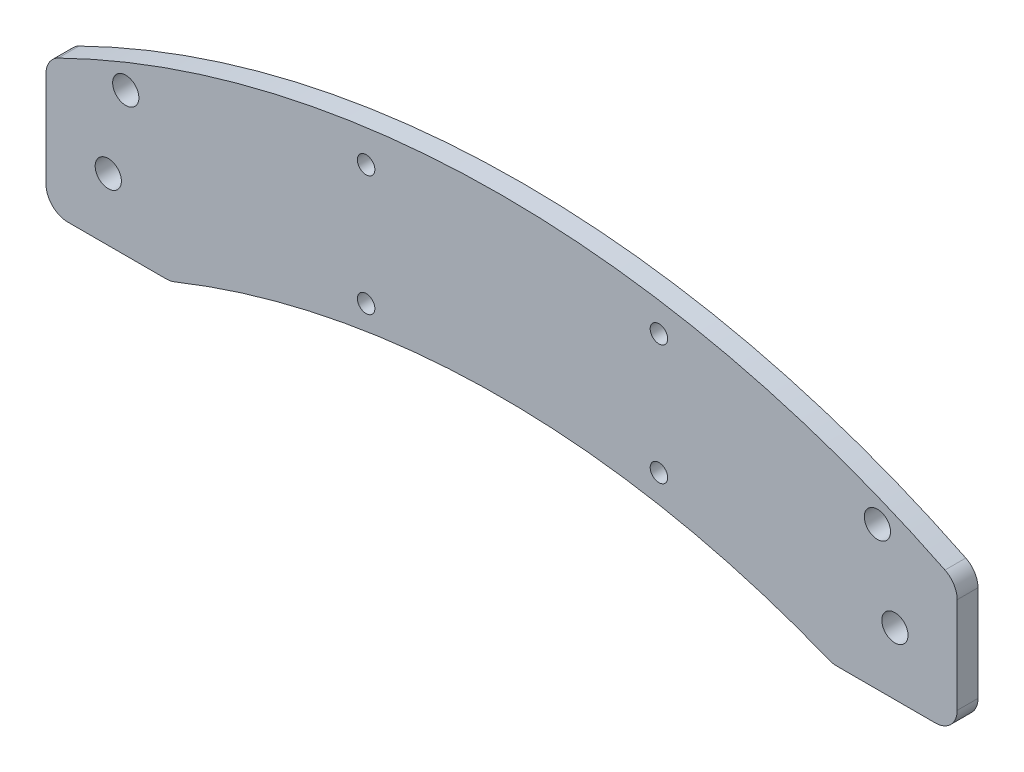
ISO-10303-21;
HEADER;
FILE_DESCRIPTION(('STEP AP214'),'2;1');
FILE_NAME('part.step','',(''),(''),'','','');
FILE_SCHEMA(('AUTOMOTIVE_DESIGN { 1 0 10303 214 1 1 1 1 }'));
ENDSEC;
DATA;
#1=APPLICATION_CONTEXT('core data for automotive mechanical design processes');
#2=APPLICATION_PROTOCOL_DEFINITION('international standard','automotive_design',2000,#1);
#3=PRODUCT_CONTEXT('',#1,'mechanical');
#4=PRODUCT('Part','Part','',(#3));
#5=PRODUCT_RELATED_PRODUCT_CATEGORY('part','',(#4));
#6=PRODUCT_DEFINITION_FORMATION('','',#4);
#7=PRODUCT_DEFINITION_CONTEXT('part definition',#1,'design');
#8=PRODUCT_DEFINITION('design','',#6,#7);
#9=PRODUCT_DEFINITION_SHAPE('','',#8);
#10=(LENGTH_UNIT() NAMED_UNIT(*) SI_UNIT(.MILLI.,.METRE.));
#11=(NAMED_UNIT(*) PLANE_ANGLE_UNIT() SI_UNIT($,.RADIAN.));
#12=(NAMED_UNIT(*) SI_UNIT($,.STERADIAN.) SOLID_ANGLE_UNIT());
#13=UNCERTAINTY_MEASURE_WITH_UNIT(LENGTH_MEASURE(1.E-05),#10,'distance_accuracy_value','');
#14=(GEOMETRIC_REPRESENTATION_CONTEXT(3) GLOBAL_UNCERTAINTY_ASSIGNED_CONTEXT((#13)) GLOBAL_UNIT_ASSIGNED_CONTEXT((#10,
#11,#12)) REPRESENTATION_CONTEXT('',''));
#15=CARTESIAN_POINT('',(0.,0.,0.));
#16=DIRECTION('',(0.,0.,1.));
#17=DIRECTION('',(1.,0.,0.));
#18=AXIS2_PLACEMENT_3D('',#15,#16,#17);
#19=CARTESIAN_POINT('',(-9.24999999999994,12.676812236513,0.));
#20=DIRECTION('',(0.,0.,-1.));
#21=DIRECTION('',(-1.,0.,0.));
#22=AXIS2_PLACEMENT_3D('',#19,#20,#21);
#23=PLANE('',#22);
#24=DIRECTION('',(-1.,0.,0.));
#25=VECTOR('',#24,1.);
#26=CARTESIAN_POINT('',(-10.,10.,0.));
#27=LINE('',#26,#25);
#28=CARTESIAN_POINT('',(10.,10.,0.));
#29=VERTEX_POINT('',#28);
#30=CARTESIAN_POINT('',(-10.,10.,0.));
#31=VERTEX_POINT('',#30);
#32=EDGE_CURVE('E209',#29,#31,#27,.T.);
#33=ORIENTED_EDGE('',*,*,#32,.T.);
#34=DIRECTION('',(0.,-1.,0.));
#35=VECTOR('',#34,1.);
#36=CARTESIAN_POINT('',(-10.,10.,0.));
#37=LINE('',#36,#35);
#38=CARTESIAN_POINT('',(-10.,-10.,0.));
#39=VERTEX_POINT('',#38);
#40=EDGE_CURVE('E62',#31,#39,#37,.T.);
#41=ORIENTED_EDGE('',*,*,#40,.T.);
#42=DIRECTION('',(1.,0.,0.));
#43=VECTOR('',#42,1.);
#44=CARTESIAN_POINT('',(-10.,-10.,0.));
#45=LINE('',#44,#43);
#46=CARTESIAN_POINT('',(10.,-10.,0.));
#47=VERTEX_POINT('',#46);
#48=EDGE_CURVE('E217',#39,#47,#45,.T.);
#49=ORIENTED_EDGE('',*,*,#48,.T.);
#50=DIRECTION('',(0.,1.,0.));
#51=VECTOR('',#50,1.);
#52=CARTESIAN_POINT('',(10.,10.,0.));
#53=LINE('',#52,#51);
#54=EDGE_CURVE('E220',#47,#29,#53,.T.);
#55=ORIENTED_EDGE('',*,*,#54,.T.);
#56=EDGE_LOOP('',(#33,#41,#49,#55));
#57=FACE_BOUND('',#56,.T.);
#58=CARTESIAN_POINT('',(4.00000000000005,18.5,0.));
#59=DIRECTION('',(0.,0.,1.));
#60=DIRECTION('',(1.,0.,0.));
#61=AXIS2_PLACEMENT_3D('',#58,#59,#60);
#62=CIRCLE('',#61,3.00000000000224);
#63=CARTESIAN_POINT('',(7.00000000000229,18.5,0.));
#64=VERTEX_POINT('',#63);
#65=EDGE_CURVE('E236',#64,#64,#62,.T.);
#66=ORIENTED_EDGE('',*,*,#65,.T.);
#67=EDGE_LOOP('',(#66));
#68=FACE_BOUND('',#67,.T.);
#69=CARTESIAN_POINT('',(125.999999999998,31.2500000000083,0.));
#70=DIRECTION('',(0.,0.,1.));
#71=DIRECTION('',(1.,0.,0.));
#72=AXIS2_PLACEMENT_3D('',#69,#70,#71);
#73=CIRCLE('',#72,2.);
#74=CARTESIAN_POINT('',(127.999999999998,31.2500000000083,0.));
#75=VERTEX_POINT('',#74);
#76=EDGE_CURVE('E255',#75,#75,#73,.T.);
#77=ORIENTED_EDGE('',*,*,#76,.T.);
#78=EDGE_LOOP('',(#77));
#79=FACE_BOUND('',#78,.T.);
#80=CARTESIAN_POINT('',(58.9999999999979,31.2500000000038,0.));
#81=DIRECTION('',(0.,0.,1.));
#82=DIRECTION('',(1.,0.,0.));
#83=AXIS2_PLACEMENT_3D('',#80,#81,#82);
#84=CIRCLE('',#83,1.99999999999999);
#85=CARTESIAN_POINT('',(60.9999999999979,31.2500000000038,0.));
#86=VERTEX_POINT('',#85);
#87=EDGE_CURVE('E267',#86,#86,#84,.T.);
#88=ORIENTED_EDGE('',*,*,#87,.T.);
#89=EDGE_LOOP('',(#88));
#90=FACE_BOUND('',#89,.T.);
#91=CARTESIAN_POINT('',(-9.24999999999994,12.676812236513,0.));
#92=DIRECTION('',(0.,0.,1.));
#93=DIRECTION('',(-1.,0.,0.));
#94=AXIS2_PLACEMENT_3D('',#91,#92,#93);
#95=CIRCLE('',#94,5.00000000000002);
#96=CARTESIAN_POINT('',(-11.4555555555555,17.1640747306577,0.));
#97=VERTEX_POINT('',#96);
#98=CARTESIAN_POINT('',(-14.2499999999999,12.676812236513,0.));
#99=VERTEX_POINT('',#98);
#100=EDGE_CURVE('E273',#97,#99,#95,.T.);
#101=ORIENTED_EDGE('',*,*,#100,.F.);
#102=CARTESIAN_POINT('',(90.0000000000002,-189.25,0.));
#103=DIRECTION('',(0.,0.,1.));
#104=DIRECTION('',(-1.,0.,0.));
#105=AXIS2_PLACEMENT_3D('',#102,#103,#104);
#106=CIRCLE('',#105,230.);
#107=CARTESIAN_POINT('',(191.455555555556,17.1640747306579,0.));
#108=VERTEX_POINT('',#107);
#109=EDGE_CURVE('E280',#108,#97,#106,.T.);
#110=ORIENTED_EDGE('',*,*,#109,.F.);
#111=CARTESIAN_POINT('',(189.25,12.6768122365132,0.));
#112=DIRECTION('',(0.,0.,1.));
#113=DIRECTION('',(-1.,0.,0.));
#114=AXIS2_PLACEMENT_3D('',#111,#112,#113);
#115=CIRCLE('',#114,5.00000000000002);
#116=CARTESIAN_POINT('',(194.25,12.6768122365132,0.));
#117=VERTEX_POINT('',#116);
#118=EDGE_CURVE('E323',#117,#108,#115,.T.);
#119=ORIENTED_EDGE('',*,*,#118,.F.);
#120=DIRECTION('',(0.,1.,0.));
#121=VECTOR('',#120,1.);
#122=CARTESIAN_POINT('',(194.25,12.6768122365132,0.));
#123=LINE('',#122,#121);
#124=CARTESIAN_POINT('',(194.25,-9.24999999999996,0.));
#125=VERTEX_POINT('',#124);
#126=EDGE_CURVE('E321',#125,#117,#123,.T.);
#127=ORIENTED_EDGE('',*,*,#126,.F.);
#128=CARTESIAN_POINT('',(189.25,-9.24999999999999,0.));
#129=DIRECTION('',(0.,0.,1.));
#130=DIRECTION('',(-1.,0.,0.));
#131=AXIS2_PLACEMENT_3D('',#128,#129,#130);
#132=CIRCLE('',#131,5.);
#133=CARTESIAN_POINT('',(189.25,-14.25,0.));
#134=VERTEX_POINT('',#133);
#135=EDGE_CURVE('E319',#134,#125,#132,.T.);
#136=ORIENTED_EDGE('',*,*,#135,.F.);
#137=DIRECTION('',(1.,0.,0.));
#138=VECTOR('',#137,1.);
#139=CARTESIAN_POINT('',(189.25,-14.25,0.));
#140=LINE('',#139,#138);
#141=CARTESIAN_POINT('',(166.727208071205,-14.2499999999998,0.));
#142=VERTEX_POINT('',#141);
#143=EDGE_CURVE('E317',#142,#134,#140,.T.);
#144=ORIENTED_EDGE('',*,*,#143,.F.);
#145=CARTESIAN_POINT('',(166.727208071205,-9.24999999999981,0.));
#146=DIRECTION('',(0.,0.,1.));
#147=DIRECTION('',(-1.,0.,0.));
#148=AXIS2_PLACEMENT_3D('',#145,#146,#147);
#149=CIRCLE('',#148,5.);
#150=CARTESIAN_POINT('',(164.855812752395,-13.8865805892635,0.));
#151=VERTEX_POINT('',#150);
#152=EDGE_CURVE('E315',#151,#142,#149,.T.);
#153=ORIENTED_EDGE('',*,*,#152,.F.);
#154=CARTESIAN_POINT('',(90.0000000000002,-199.34980415981,0.));
#155=DIRECTION('',(0.,0.,-1.));
#156=DIRECTION('',(1.,0.,0.));
#157=AXIS2_PLACEMENT_3D('',#154,#155,#156);
#158=CIRCLE('',#157,200.);
#159=CARTESIAN_POINT('',(15.1441872476054,-13.8865805892636,0.));
#160=VERTEX_POINT('',#159);
#161=EDGE_CURVE('E313',#160,#151,#158,.T.);
#162=ORIENTED_EDGE('',*,*,#161,.F.);
#163=CARTESIAN_POINT('',(13.2727919287955,-9.24999999999995,0.));
#164=DIRECTION('',(0.,0.,1.));
#165=DIRECTION('',(-1.,0.,0.));
#166=AXIS2_PLACEMENT_3D('',#163,#164,#165);
#167=CIRCLE('',#166,5.00000000000002);
#168=CARTESIAN_POINT('',(13.2727919287955,-14.25,0.));
#169=VERTEX_POINT('',#168);
#170=EDGE_CURVE('E311',#169,#160,#167,.T.);
#171=ORIENTED_EDGE('',*,*,#170,.F.);
#172=DIRECTION('',(1.,0.,0.));
#173=VECTOR('',#172,1.);
#174=CARTESIAN_POINT('',(13.2727919287955,-14.25,0.));
#175=LINE('',#174,#173);
#176=CARTESIAN_POINT('',(-9.24999999999712,-14.2500000000014,0.));
#177=VERTEX_POINT('',#176);
#178=EDGE_CURVE('E309',#177,#169,#175,.T.);
#179=ORIENTED_EDGE('',*,*,#178,.F.);
#180=CARTESIAN_POINT('',(-9.24999999999715,-9.25000000000141,0.));
#181=DIRECTION('',(0.,0.,1.));
#182=DIRECTION('',(1.,0.,0.));
#183=AXIS2_PLACEMENT_3D('',#180,#181,#182);
#184=CIRCLE('',#183,5.);
#185=CARTESIAN_POINT('',(-14.2499999999972,-9.25000000000138,0.));
#186=VERTEX_POINT('',#185);
#187=EDGE_CURVE('E307',#186,#177,#184,.T.);
#188=ORIENTED_EDGE('',*,*,#187,.F.);
#189=DIRECTION('',(1.26978383766439E-13,-1.,0.));
#190=VECTOR('',#189,1.);
#191=CARTESIAN_POINT('',(-14.2499999999972,-9.25000000000138,0.));
#192=LINE('',#191,#190);
#193=EDGE_CURVE('E305',#99,#186,#192,.T.);
#194=ORIENTED_EDGE('',*,*,#193,.F.);
#195=EDGE_LOOP('',(#101,#110,#119,#127,#136,#144,#153,#162,#171,#179,#188,#194));
#196=FACE_BOUND('',#195,.T.);
#197=CARTESIAN_POINT('',(58.9999999999998,3.75000000000379,0.));
#198=DIRECTION('',(0.,0.,1.));
#199=DIRECTION('',(1.,0.,0.));
#200=AXIS2_PLACEMENT_3D('',#197,#198,#199);
#201=CIRCLE('',#200,1.99999999999999);
#202=CARTESIAN_POINT('',(60.9999999999998,3.75000000000379,0.));
#203=VERTEX_POINT('',#202);
#204=EDGE_CURVE('E261',#203,#203,#201,.T.);
#205=ORIENTED_EDGE('',*,*,#204,.T.);
#206=EDGE_LOOP('',(#205));
#207=FACE_BOUND('',#206,.T.);
#208=CARTESIAN_POINT('',(126.,3.75000000000828,0.));
#209=DIRECTION('',(0.,0.,1.));
#210=DIRECTION('',(1.,0.,0.));
#211=AXIS2_PLACEMENT_3D('',#208,#209,#210);
#212=CIRCLE('',#211,2.);
#213=CARTESIAN_POINT('',(128.,3.75000000000828,0.));
#214=VERTEX_POINT('',#213);
#215=EDGE_CURVE('E251',#214,#214,#212,.T.);
#216=ORIENTED_EDGE('',*,*,#215,.T.);
#217=EDGE_LOOP('',(#216));
#218=FACE_BOUND('',#217,.T.);
#219=CARTESIAN_POINT('',(176.,18.5000000000002,0.));
#220=DIRECTION('',(0.,0.,1.));
#221=DIRECTION('',(1.,0.,0.));
#222=AXIS2_PLACEMENT_3D('',#219,#220,#221);
#223=CIRCLE('',#222,2.99999999999999);
#224=CARTESIAN_POINT('',(179.,18.5000000000002,0.));
#225=VERTEX_POINT('',#224);
#226=EDGE_CURVE('E237',#225,#225,#223,.T.);
#227=ORIENTED_EDGE('',*,*,#226,.T.);
#228=EDGE_LOOP('',(#227));
#229=FACE_BOUND('',#228,.T.);
#230=DIRECTION('',(-1.,0.,0.));
#231=VECTOR('',#230,1.);
#232=CARTESIAN_POINT('',(170.,10.,0.));
#233=LINE('',#232,#231);
#234=CARTESIAN_POINT('',(190.,10.,0.));
#235=VERTEX_POINT('',#234);
#236=CARTESIAN_POINT('',(170.,10.,0.));
#237=VERTEX_POINT('',#236);
#238=EDGE_CURVE('E193',#235,#237,#233,.T.);
#239=ORIENTED_EDGE('',*,*,#238,.T.);
#240=DIRECTION('',(0.,-1.,0.));
#241=VECTOR('',#240,1.);
#242=CARTESIAN_POINT('',(170.,10.,0.));
#243=LINE('',#242,#241);
#244=CARTESIAN_POINT('',(170.,-9.99999999999996,0.));
#245=VERTEX_POINT('',#244);
#246=EDGE_CURVE('E54',#237,#245,#243,.T.);
#247=ORIENTED_EDGE('',*,*,#246,.T.);
#248=DIRECTION('',(1.,0.,0.));
#249=VECTOR('',#248,1.);
#250=CARTESIAN_POINT('',(170.,-9.99999999999996,0.));
#251=LINE('',#250,#249);
#252=CARTESIAN_POINT('',(190.,-9.99999999999996,0.));
#253=VERTEX_POINT('',#252);
#254=EDGE_CURVE('E197',#245,#253,#251,.T.);
#255=ORIENTED_EDGE('',*,*,#254,.T.);
#256=DIRECTION('',(0.,1.,0.));
#257=VECTOR('',#256,1.);
#258=CARTESIAN_POINT('',(190.,10.,0.));
#259=LINE('',#258,#257);
#260=EDGE_CURVE('E392',#253,#235,#259,.T.);
#261=ORIENTED_EDGE('',*,*,#260,.T.);
#262=EDGE_LOOP('',(#239,#247,#255,#261));
#263=FACE_BOUND('',#262,.T.);
#264=ADVANCED_FACE('F37',(#57,#68,#79,#90,#196,#207,#218,#229,#263),#23,.T.);
#265=CARTESIAN_POINT('',(-9.24999999999994,12.676812236513,4.7625));
#266=DIRECTION('',(0.,0.,-1.));
#267=DIRECTION('',(-1.,0.,0.));
#268=AXIS2_PLACEMENT_3D('',#265,#266,#267);
#269=PLANE('',#268);
#270=CARTESIAN_POINT('',(4.00000000000005,18.5,4.7625));
#271=DIRECTION('',(0.,0.,1.));
#272=DIRECTION('',(1.,0.,0.));
#273=AXIS2_PLACEMENT_3D('',#270,#271,#272);
#274=CIRCLE('',#273,3.00000000000224);
#275=CARTESIAN_POINT('',(7.00000000000229,18.5,4.7625));
#276=VERTEX_POINT('',#275);
#277=EDGE_CURVE('E240',#276,#276,#274,.T.);
#278=ORIENTED_EDGE('',*,*,#277,.F.);
#279=EDGE_LOOP('',(#278));
#280=FACE_BOUND('',#279,.T.);
#281=CARTESIAN_POINT('',(180.,0.,4.7625));
#282=DIRECTION('',(0.,0.,1.));
#283=DIRECTION('',(1.,0.,0.));
#284=AXIS2_PLACEMENT_3D('',#281,#282,#283);
#285=CIRCLE('',#284,2.99999999999999);
#286=CARTESIAN_POINT('',(183.,0.,4.7625));
#287=VERTEX_POINT('',#286);
#288=EDGE_CURVE('E248',#287,#287,#285,.T.);
#289=ORIENTED_EDGE('',*,*,#288,.F.);
#290=EDGE_LOOP('',(#289));
#291=FACE_BOUND('',#290,.T.);
#292=CARTESIAN_POINT('',(125.999999999998,31.2500000000083,4.7625));
#293=DIRECTION('',(0.,0.,1.));
#294=DIRECTION('',(1.,0.,0.));
#295=AXIS2_PLACEMENT_3D('',#292,#293,#294);
#296=CIRCLE('',#295,2.);
#297=CARTESIAN_POINT('',(127.999999999998,31.2500000000083,4.7625));
#298=VERTEX_POINT('',#297);
#299=EDGE_CURVE('E258',#298,#298,#296,.T.);
#300=ORIENTED_EDGE('',*,*,#299,.F.);
#301=EDGE_LOOP('',(#300));
#302=FACE_BOUND('',#301,.T.);
#303=CARTESIAN_POINT('',(58.9999999999979,31.2500000000038,4.7625));
#304=DIRECTION('',(0.,0.,1.));
#305=DIRECTION('',(1.,0.,0.));
#306=AXIS2_PLACEMENT_3D('',#303,#304,#305);
#307=CIRCLE('',#306,1.99999999999999);
#308=CARTESIAN_POINT('',(60.9999999999979,31.2500000000038,4.7625));
#309=VERTEX_POINT('',#308);
#310=EDGE_CURVE('E270',#309,#309,#307,.T.);
#311=ORIENTED_EDGE('',*,*,#310,.F.);
#312=EDGE_LOOP('',(#311));
#313=FACE_BOUND('',#312,.T.);
#314=CARTESIAN_POINT('',(-9.24999999999994,12.676812236513,4.7625));
#315=DIRECTION('',(0.,0.,1.));
#316=DIRECTION('',(-1.,0.,0.));
#317=AXIS2_PLACEMENT_3D('',#314,#315,#316);
#318=CIRCLE('',#317,5.00000000000002);
#319=CARTESIAN_POINT('',(-11.4555555555555,17.1640747306577,4.7625));
#320=VERTEX_POINT('',#319);
#321=CARTESIAN_POINT('',(-14.2499999999999,12.676812236513,4.7625));
#322=VERTEX_POINT('',#321);
#323=EDGE_CURVE('E276',#320,#322,#318,.T.);
#324=ORIENTED_EDGE('',*,*,#323,.T.);
#325=DIRECTION('',(1.26978383766439E-13,-1.,0.));
#326=VECTOR('',#325,1.);
#327=CARTESIAN_POINT('',(-14.2499999999972,-9.25000000000138,4.7625));
#328=LINE('',#327,#326);
#329=CARTESIAN_POINT('',(-14.2499999999972,-9.25000000000138,4.7625));
#330=VERTEX_POINT('',#329);
#331=EDGE_CURVE('E279',#322,#330,#328,.T.);
#332=ORIENTED_EDGE('',*,*,#331,.T.);
#333=CARTESIAN_POINT('',(-9.24999999999715,-9.25000000000141,4.7625));
#334=DIRECTION('',(0.,0.,1.));
#335=DIRECTION('',(1.,0.,0.));
#336=AXIS2_PLACEMENT_3D('',#333,#334,#335);
#337=CIRCLE('',#336,5.);
#338=CARTESIAN_POINT('',(-9.24999999999712,-14.2500000000014,4.7625));
#339=VERTEX_POINT('',#338);
#340=EDGE_CURVE('E282',#330,#339,#337,.T.);
#341=ORIENTED_EDGE('',*,*,#340,.T.);
#342=DIRECTION('',(1.,0.,0.));
#343=VECTOR('',#342,1.);
#344=CARTESIAN_POINT('',(13.2727919287955,-14.25,4.7625));
#345=LINE('',#344,#343);
#346=CARTESIAN_POINT('',(13.2727919287955,-14.25,4.7625));
#347=VERTEX_POINT('',#346);
#348=EDGE_CURVE('E284',#339,#347,#345,.T.);
#349=ORIENTED_EDGE('',*,*,#348,.T.);
#350=CARTESIAN_POINT('',(13.2727919287955,-9.24999999999995,4.7625));
#351=DIRECTION('',(0.,0.,1.));
#352=DIRECTION('',(-1.,0.,0.));
#353=AXIS2_PLACEMENT_3D('',#350,#351,#352);
#354=CIRCLE('',#353,5.00000000000002);
#355=CARTESIAN_POINT('',(15.1441872476054,-13.8865805892636,4.7625));
#356=VERTEX_POINT('',#355);
#357=EDGE_CURVE('E286',#347,#356,#354,.T.);
#358=ORIENTED_EDGE('',*,*,#357,.T.);
#359=CARTESIAN_POINT('',(90.0000000000002,-199.34980415981,4.7625));
#360=DIRECTION('',(0.,0.,-1.));
#361=DIRECTION('',(1.,0.,0.));
#362=AXIS2_PLACEMENT_3D('',#359,#360,#361);
#363=CIRCLE('',#362,200.);
#364=CARTESIAN_POINT('',(164.855812752395,-13.8865805892635,4.7625));
#365=VERTEX_POINT('',#364);
#366=EDGE_CURVE('E288',#356,#365,#363,.T.);
#367=ORIENTED_EDGE('',*,*,#366,.T.);
#368=CARTESIAN_POINT('',(166.727208071205,-9.24999999999981,4.7625));
#369=DIRECTION('',(0.,0.,1.));
#370=DIRECTION('',(-1.,0.,0.));
#371=AXIS2_PLACEMENT_3D('',#368,#369,#370);
#372=CIRCLE('',#371,5.);
#373=CARTESIAN_POINT('',(166.727208071205,-14.2499999999998,4.7625));
#374=VERTEX_POINT('',#373);
#375=EDGE_CURVE('E290',#365,#374,#372,.T.);
#376=ORIENTED_EDGE('',*,*,#375,.T.);
#377=DIRECTION('',(1.,0.,0.));
#378=VECTOR('',#377,1.);
#379=CARTESIAN_POINT('',(189.25,-14.25,4.7625));
#380=LINE('',#379,#378);
#381=CARTESIAN_POINT('',(189.25,-14.25,4.7625));
#382=VERTEX_POINT('',#381);
#383=EDGE_CURVE('E292',#374,#382,#380,.T.);
#384=ORIENTED_EDGE('',*,*,#383,.T.);
#385=CARTESIAN_POINT('',(189.25,-9.24999999999999,4.7625));
#386=DIRECTION('',(0.,0.,1.));
#387=DIRECTION('',(-1.,0.,0.));
#388=AXIS2_PLACEMENT_3D('',#385,#386,#387);
#389=CIRCLE('',#388,5.);
#390=CARTESIAN_POINT('',(194.25,-9.24999999999996,4.7625));
#391=VERTEX_POINT('',#390);
#392=EDGE_CURVE('E294',#382,#391,#389,.T.);
#393=ORIENTED_EDGE('',*,*,#392,.T.);
#394=DIRECTION('',(0.,1.,0.));
#395=VECTOR('',#394,1.);
#396=CARTESIAN_POINT('',(194.25,12.6768122365132,4.7625));
#397=LINE('',#396,#395);
#398=CARTESIAN_POINT('',(194.25,12.6768122365132,4.7625));
#399=VERTEX_POINT('',#398);
#400=EDGE_CURVE('E296',#391,#399,#397,.T.);
#401=ORIENTED_EDGE('',*,*,#400,.T.);
#402=CARTESIAN_POINT('',(189.25,12.6768122365132,4.7625));
#403=DIRECTION('',(0.,0.,1.));
#404=DIRECTION('',(-1.,0.,0.));
#405=AXIS2_PLACEMENT_3D('',#402,#403,#404);
#406=CIRCLE('',#405,5.00000000000002);
#407=CARTESIAN_POINT('',(191.455555555556,17.1640747306579,4.7625));
#408=VERTEX_POINT('',#407);
#409=EDGE_CURVE('E298',#399,#408,#406,.T.);
#410=ORIENTED_EDGE('',*,*,#409,.T.);
#411=CARTESIAN_POINT('',(90.0000000000002,-189.25,4.7625));
#412=DIRECTION('',(0.,0.,1.));
#413=DIRECTION('',(-1.,0.,0.));
#414=AXIS2_PLACEMENT_3D('',#411,#412,#413);
#415=CIRCLE('',#414,230.);
#416=EDGE_CURVE('E300',#408,#320,#415,.T.);
#417=ORIENTED_EDGE('',*,*,#416,.T.);
#418=EDGE_LOOP('',(#324,#332,#341,#349,#358,#367,#376,#384,#393,#401,#410,#417));
#419=FACE_BOUND('',#418,.T.);
#420=CARTESIAN_POINT('',(58.9999999999998,3.75000000000379,4.7625));
#421=DIRECTION('',(0.,0.,1.));
#422=DIRECTION('',(1.,0.,0.));
#423=AXIS2_PLACEMENT_3D('',#420,#421,#422);
#424=CIRCLE('',#423,1.99999999999999);
#425=CARTESIAN_POINT('',(60.9999999999998,3.75000000000379,4.7625));
#426=VERTEX_POINT('',#425);
#427=EDGE_CURVE('E264',#426,#426,#424,.T.);
#428=ORIENTED_EDGE('',*,*,#427,.F.);
#429=EDGE_LOOP('',(#428));
#430=FACE_BOUND('',#429,.T.);
#431=CARTESIAN_POINT('',(126.,3.75000000000828,4.7625));
#432=DIRECTION('',(0.,0.,1.));
#433=DIRECTION('',(1.,0.,0.));
#434=AXIS2_PLACEMENT_3D('',#431,#432,#433);
#435=CIRCLE('',#434,2.);
#436=CARTESIAN_POINT('',(128.,3.75000000000828,4.7625));
#437=VERTEX_POINT('',#436);
#438=EDGE_CURVE('E252',#437,#437,#435,.T.);
#439=ORIENTED_EDGE('',*,*,#438,.F.);
#440=EDGE_LOOP('',(#439));
#441=FACE_BOUND('',#440,.T.);
#442=CARTESIAN_POINT('',(0.,0.,4.7625));
#443=DIRECTION('',(0.,0.,1.));
#444=DIRECTION('',(1.,0.,0.));
#445=AXIS2_PLACEMENT_3D('',#442,#443,#444);
#446=CIRCLE('',#445,3.);
#447=CARTESIAN_POINT('',(3.,0.,4.7625));
#448=VERTEX_POINT('',#447);
#449=EDGE_CURVE('E243',#448,#448,#446,.T.);
#450=ORIENTED_EDGE('',*,*,#449,.F.);
#451=EDGE_LOOP('',(#450));
#452=FACE_BOUND('',#451,.T.);
#453=CARTESIAN_POINT('',(176.,18.5000000000002,4.7625));
#454=DIRECTION('',(0.,0.,1.));
#455=DIRECTION('',(1.,0.,0.));
#456=AXIS2_PLACEMENT_3D('',#453,#454,#455);
#457=CIRCLE('',#456,2.99999999999999);
#458=CARTESIAN_POINT('',(179.,18.5000000000002,4.7625));
#459=VERTEX_POINT('',#458);
#460=EDGE_CURVE('E233',#459,#459,#457,.T.);
#461=ORIENTED_EDGE('',*,*,#460,.F.);
#462=EDGE_LOOP('',(#461));
#463=FACE_BOUND('',#462,.T.);
#464=ADVANCED_FACE('F370',(#280,#291,#302,#313,#419,#430,#441,#452,#463),#269,.F.);
#465=CARTESIAN_POINT('',(-9.24999999999994,12.676812236513,4.7625));
#466=DIRECTION('',(0.,0.,-1.));
#467=DIRECTION('',(-1.,0.,0.));
#468=AXIS2_PLACEMENT_3D('',#465,#466,#467);
#469=CYLINDRICAL_SURFACE('',#468,5.00000000000002);
#470=ORIENTED_EDGE('',*,*,#100,.T.);
#471=DIRECTION('',(0.,0.,-1.));
#472=VECTOR('',#471,1.);
#473=CARTESIAN_POINT('',(-14.2499999999999,12.676812236513,4.7625));
#474=LINE('',#473,#472);
#475=EDGE_CURVE('E11',#322,#99,#474,.T.);
#476=ORIENTED_EDGE('',*,*,#475,.F.);
#477=ORIENTED_EDGE('',*,*,#323,.F.);
#478=DIRECTION('',(0.,0.,-1.));
#479=VECTOR('',#478,1.);
#480=CARTESIAN_POINT('',(-11.4555555555555,17.1640747306577,4.7625));
#481=LINE('',#480,#479);
#482=EDGE_CURVE('E302',#320,#97,#481,.T.);
#483=ORIENTED_EDGE('',*,*,#482,.T.);
#484=EDGE_LOOP('',(#470,#476,#477,#483));
#485=FACE_BOUND('',#484,.T.);
#486=ADVANCED_FACE('F39',(#485),#469,.T.);
#487=CARTESIAN_POINT('',(-14.2499999999972,-9.25000000000138,4.7625));
#488=DIRECTION('',(1.,1.26978383766439E-13,0.));
#489=DIRECTION('',(-1.26978383766439E-13,1.,0.));
#490=AXIS2_PLACEMENT_3D('',#487,#488,#489);
#491=PLANE('',#490);
#492=ORIENTED_EDGE('',*,*,#193,.T.);
#493=DIRECTION('',(0.,0.,-1.));
#494=VECTOR('',#493,1.);
#495=CARTESIAN_POINT('',(-14.2499999999972,-9.25000000000138,4.7625));
#496=LINE('',#495,#494);
#497=EDGE_CURVE('E46',#330,#186,#496,.T.);
#498=ORIENTED_EDGE('',*,*,#497,.F.);
#499=ORIENTED_EDGE('',*,*,#331,.F.);
#500=ORIENTED_EDGE('',*,*,#475,.T.);
#501=EDGE_LOOP('',(#492,#498,#499,#500));
#502=FACE_BOUND('',#501,.T.);
#503=ADVANCED_FACE('F496',(#502),#491,.F.);
#504=CARTESIAN_POINT('',(-9.24999999999715,-9.25000000000141,4.7625));
#505=DIRECTION('',(0.,0.,-1.));
#506=DIRECTION('',(-1.,0.,0.));
#507=AXIS2_PLACEMENT_3D('',#504,#505,#506);
#508=CYLINDRICAL_SURFACE('',#507,5.);
#509=ORIENTED_EDGE('',*,*,#187,.T.);
#510=DIRECTION('',(0.,0.,-1.));
#511=VECTOR('',#510,1.);
#512=CARTESIAN_POINT('',(-9.24999999999712,-14.2500000000014,4.7625));
#513=LINE('',#512,#511);
#514=EDGE_CURVE('E352',#339,#177,#513,.T.);
#515=ORIENTED_EDGE('',*,*,#514,.F.);
#516=ORIENTED_EDGE('',*,*,#340,.F.);
#517=ORIENTED_EDGE('',*,*,#497,.T.);
#518=EDGE_LOOP('',(#509,#515,#516,#517));
#519=FACE_BOUND('',#518,.T.);
#520=ADVANCED_FACE('F493',(#519),#508,.T.);
#521=CARTESIAN_POINT('',(13.2727919287955,-14.25,4.7625));
#522=DIRECTION('',(0.,1.,0.));
#523=DIRECTION('',(-1.,0.,0.));
#524=AXIS2_PLACEMENT_3D('',#521,#522,#523);
#525=PLANE('',#524);
#526=ORIENTED_EDGE('',*,*,#178,.T.);
#527=DIRECTION('',(0.,0.,-1.));
#528=VECTOR('',#527,1.);
#529=CARTESIAN_POINT('',(13.2727919287955,-14.25,4.7625));
#530=LINE('',#529,#528);
#531=EDGE_CURVE('E349',#347,#169,#530,.T.);
#532=ORIENTED_EDGE('',*,*,#531,.F.);
#533=ORIENTED_EDGE('',*,*,#348,.F.);
#534=ORIENTED_EDGE('',*,*,#514,.T.);
#535=EDGE_LOOP('',(#526,#532,#533,#534));
#536=FACE_BOUND('',#535,.T.);
#537=ADVANCED_FACE('F489',(#536),#525,.F.);
#538=CARTESIAN_POINT('',(13.2727919287955,-9.24999999999995,4.7625));
#539=DIRECTION('',(0.,0.,-1.));
#540=DIRECTION('',(-1.,0.,0.));
#541=AXIS2_PLACEMENT_3D('',#538,#539,#540);
#542=CYLINDRICAL_SURFACE('',#541,5.00000000000002);
#543=ORIENTED_EDGE('',*,*,#170,.T.);
#544=DIRECTION('',(0.,0.,-1.));
#545=VECTOR('',#544,1.);
#546=CARTESIAN_POINT('',(15.1441872476054,-13.8865805892636,4.7625));
#547=LINE('',#546,#545);
#548=EDGE_CURVE('E346',#356,#160,#547,.T.);
#549=ORIENTED_EDGE('',*,*,#548,.F.);
#550=ORIENTED_EDGE('',*,*,#357,.F.);
#551=ORIENTED_EDGE('',*,*,#531,.T.);
#552=EDGE_LOOP('',(#543,#549,#550,#551));
#553=FACE_BOUND('',#552,.T.);
#554=ADVANCED_FACE('F485',(#553),#542,.T.);
#555=CARTESIAN_POINT('',(90.0000000000002,-199.34980415981,4.7625));
#556=DIRECTION('',(0.,0.,-1.));
#557=DIRECTION('',(-1.,0.,0.));
#558=AXIS2_PLACEMENT_3D('',#555,#556,#557);
#559=CYLINDRICAL_SURFACE('',#558,200.);
#560=ORIENTED_EDGE('',*,*,#161,.T.);
#561=DIRECTION('',(0.,0.,-1.));
#562=VECTOR('',#561,1.);
#563=CARTESIAN_POINT('',(164.855812752395,-13.8865805892635,4.7625));
#564=LINE('',#563,#562);
#565=EDGE_CURVE('E343',#365,#151,#564,.T.);
#566=ORIENTED_EDGE('',*,*,#565,.F.);
#567=ORIENTED_EDGE('',*,*,#366,.F.);
#568=ORIENTED_EDGE('',*,*,#548,.T.);
#569=EDGE_LOOP('',(#560,#566,#567,#568));
#570=FACE_BOUND('',#569,.T.);
#571=ADVANCED_FACE('F481',(#570),#559,.F.);
#572=CARTESIAN_POINT('',(166.727208071205,-9.24999999999981,4.7625));
#573=DIRECTION('',(0.,0.,-1.));
#574=DIRECTION('',(-1.,0.,0.));
#575=AXIS2_PLACEMENT_3D('',#572,#573,#574);
#576=CYLINDRICAL_SURFACE('',#575,5.);
#577=ORIENTED_EDGE('',*,*,#152,.T.);
#578=DIRECTION('',(0.,0.,-1.));
#579=VECTOR('',#578,1.);
#580=CARTESIAN_POINT('',(166.727208071205,-14.2499999999998,4.7625));
#581=LINE('',#580,#579);
#582=EDGE_CURVE('E340',#374,#142,#581,.T.);
#583=ORIENTED_EDGE('',*,*,#582,.F.);
#584=ORIENTED_EDGE('',*,*,#375,.F.);
#585=ORIENTED_EDGE('',*,*,#565,.T.);
#586=EDGE_LOOP('',(#577,#583,#584,#585));
#587=FACE_BOUND('',#586,.T.);
#588=ADVANCED_FACE('F477',(#587),#576,.T.);
#589=CARTESIAN_POINT('',(189.25,-14.25,4.7625));
#590=DIRECTION('',(0.,1.,0.));
#591=DIRECTION('',(-1.,0.,0.));
#592=AXIS2_PLACEMENT_3D('',#589,#590,#591);
#593=PLANE('',#592);
#594=ORIENTED_EDGE('',*,*,#143,.T.);
#595=DIRECTION('',(0.,0.,-1.));
#596=VECTOR('',#595,1.);
#597=CARTESIAN_POINT('',(189.25,-14.25,4.7625));
#598=LINE('',#597,#596);
#599=EDGE_CURVE('E337',#382,#134,#598,.T.);
#600=ORIENTED_EDGE('',*,*,#599,.F.);
#601=ORIENTED_EDGE('',*,*,#383,.F.);
#602=ORIENTED_EDGE('',*,*,#582,.T.);
#603=EDGE_LOOP('',(#594,#600,#601,#602));
#604=FACE_BOUND('',#603,.T.);
#605=ADVANCED_FACE('F473',(#604),#593,.F.);
#606=CARTESIAN_POINT('',(189.25,-9.24999999999999,4.7625));
#607=DIRECTION('',(0.,0.,-1.));
#608=DIRECTION('',(-1.,0.,0.));
#609=AXIS2_PLACEMENT_3D('',#606,#607,#608);
#610=CYLINDRICAL_SURFACE('',#609,5.);
#611=ORIENTED_EDGE('',*,*,#135,.T.);
#612=DIRECTION('',(0.,0.,-1.));
#613=VECTOR('',#612,1.);
#614=CARTESIAN_POINT('',(194.25,-9.24999999999996,4.7625));
#615=LINE('',#614,#613);
#616=EDGE_CURVE('E334',#391,#125,#615,.T.);
#617=ORIENTED_EDGE('',*,*,#616,.F.);
#618=ORIENTED_EDGE('',*,*,#392,.F.);
#619=ORIENTED_EDGE('',*,*,#599,.T.);
#620=EDGE_LOOP('',(#611,#617,#618,#619));
#621=FACE_BOUND('',#620,.T.);
#622=ADVANCED_FACE('F469',(#621),#610,.T.);
#623=CARTESIAN_POINT('',(194.25,12.6768122365132,4.7625));
#624=DIRECTION('',(-1.,0.,0.));
#625=DIRECTION('',(0.,-1.,0.));
#626=AXIS2_PLACEMENT_3D('',#623,#624,#625);
#627=PLANE('',#626);
#628=ORIENTED_EDGE('',*,*,#126,.T.);
#629=DIRECTION('',(0.,0.,-1.));
#630=VECTOR('',#629,1.);
#631=CARTESIAN_POINT('',(194.25,12.6768122365132,4.7625));
#632=LINE('',#631,#630);
#633=EDGE_CURVE('E331',#399,#117,#632,.T.);
#634=ORIENTED_EDGE('',*,*,#633,.F.);
#635=ORIENTED_EDGE('',*,*,#400,.F.);
#636=ORIENTED_EDGE('',*,*,#616,.T.);
#637=EDGE_LOOP('',(#628,#634,#635,#636));
#638=FACE_BOUND('',#637,.T.);
#639=ADVANCED_FACE('F465',(#638),#627,.F.);
#640=CARTESIAN_POINT('',(189.25,12.6768122365132,4.7625));
#641=DIRECTION('',(0.,0.,-1.));
#642=DIRECTION('',(-1.,0.,0.));
#643=AXIS2_PLACEMENT_3D('',#640,#641,#642);
#644=CYLINDRICAL_SURFACE('',#643,5.00000000000002);
#645=ORIENTED_EDGE('',*,*,#118,.T.);
#646=DIRECTION('',(0.,0.,-1.));
#647=VECTOR('',#646,1.);
#648=CARTESIAN_POINT('',(191.455555555556,17.1640747306579,4.7625));
#649=LINE('',#648,#647);
#650=EDGE_CURVE('E328',#408,#108,#649,.T.);
#651=ORIENTED_EDGE('',*,*,#650,.F.);
#652=ORIENTED_EDGE('',*,*,#409,.F.);
#653=ORIENTED_EDGE('',*,*,#633,.T.);
#654=EDGE_LOOP('',(#645,#651,#652,#653));
#655=FACE_BOUND('',#654,.T.);
#656=ADVANCED_FACE('F461',(#655),#644,.T.);
#657=CARTESIAN_POINT('',(90.0000000000002,-189.25,4.7625));
#658=DIRECTION('',(0.,0.,-1.));
#659=DIRECTION('',(-1.,0.,0.));
#660=AXIS2_PLACEMENT_3D('',#657,#658,#659);
#661=CYLINDRICAL_SURFACE('',#660,230.);
#662=ORIENTED_EDGE('',*,*,#109,.T.);
#663=ORIENTED_EDGE('',*,*,#482,.F.);
#664=ORIENTED_EDGE('',*,*,#416,.F.);
#665=ORIENTED_EDGE('',*,*,#650,.T.);
#666=EDGE_LOOP('',(#662,#663,#664,#665));
#667=FACE_BOUND('',#666,.T.);
#668=ADVANCED_FACE('F456',(#667),#661,.T.);
#669=CARTESIAN_POINT('',(58.9999999999979,31.2500000000038,4.7625));
#670=DIRECTION('',(0.,0.,-1.));
#671=DIRECTION('',(-1.,0.,0.));
#672=AXIS2_PLACEMENT_3D('',#669,#670,#671);
#673=CYLINDRICAL_SURFACE('',#672,1.99999999999999);
#674=ORIENTED_EDGE('',*,*,#310,.T.);
#675=EDGE_LOOP('',(#674));
#676=FACE_BOUND('',#675,.T.);
#677=ORIENTED_EDGE('',*,*,#87,.F.);
#678=EDGE_LOOP('',(#677));
#679=FACE_BOUND('',#678,.T.);
#680=ADVANCED_FACE('F453',(#676,#679),#673,.F.);
#681=CARTESIAN_POINT('',(58.9999999999998,3.75000000000379,4.7625));
#682=DIRECTION('',(0.,0.,-1.));
#683=DIRECTION('',(-1.,0.,0.));
#684=AXIS2_PLACEMENT_3D('',#681,#682,#683);
#685=CYLINDRICAL_SURFACE('',#684,1.99999999999999);
#686=ORIENTED_EDGE('',*,*,#427,.T.);
#687=EDGE_LOOP('',(#686));
#688=FACE_BOUND('',#687,.T.);
#689=ORIENTED_EDGE('',*,*,#204,.F.);
#690=EDGE_LOOP('',(#689));
#691=FACE_BOUND('',#690,.T.);
#692=ADVANCED_FACE('F449',(#688,#691),#685,.F.);
#693=CARTESIAN_POINT('',(125.999999999998,31.2500000000083,4.7625));
#694=DIRECTION('',(0.,0.,-1.));
#695=DIRECTION('',(-1.,0.,0.));
#696=AXIS2_PLACEMENT_3D('',#693,#694,#695);
#697=CYLINDRICAL_SURFACE('',#696,2.);
#698=ORIENTED_EDGE('',*,*,#299,.T.);
#699=EDGE_LOOP('',(#698));
#700=FACE_BOUND('',#699,.T.);
#701=ORIENTED_EDGE('',*,*,#76,.F.);
#702=EDGE_LOOP('',(#701));
#703=FACE_BOUND('',#702,.T.);
#704=ADVANCED_FACE('F445',(#700,#703),#697,.F.);
#705=CARTESIAN_POINT('',(126.,3.75000000000828,4.7625));
#706=DIRECTION('',(0.,0.,-1.));
#707=DIRECTION('',(-1.,0.,0.));
#708=AXIS2_PLACEMENT_3D('',#705,#706,#707);
#709=CYLINDRICAL_SURFACE('',#708,2.);
#710=ORIENTED_EDGE('',*,*,#438,.T.);
#711=EDGE_LOOP('',(#710));
#712=FACE_BOUND('',#711,.T.);
#713=ORIENTED_EDGE('',*,*,#215,.F.);
#714=EDGE_LOOP('',(#713));
#715=FACE_BOUND('',#714,.T.);
#716=ADVANCED_FACE('F441',(#712,#715),#709,.F.);
#717=CARTESIAN_POINT('',(180.,0.,4.7625));
#718=DIRECTION('',(0.,0.,-1.));
#719=DIRECTION('',(-1.,0.,0.));
#720=AXIS2_PLACEMENT_3D('',#717,#718,#719);
#721=CYLINDRICAL_SURFACE('',#720,2.99999999999999);
#722=CARTESIAN_POINT('',(180.,0.,0.00999999999999959));
#723=DIRECTION('',(0.,0.,1.));
#724=DIRECTION('',(1.,0.,0.));
#725=AXIS2_PLACEMENT_3D('',#722,#723,#724);
#726=CIRCLE('',#725,2.99999999999999);
#727=CARTESIAN_POINT('',(183.,0.,0.00999999999999959));
#728=VERTEX_POINT('',#727);
#729=EDGE_CURVE('E41',#728,#728,#726,.T.);
#730=ORIENTED_EDGE('',*,*,#729,.F.);
#731=EDGE_LOOP('',(#730));
#732=FACE_BOUND('',#731,.T.);
#733=ORIENTED_EDGE('',*,*,#288,.T.);
#734=EDGE_LOOP('',(#733));
#735=FACE_BOUND('',#734,.T.);
#736=ADVANCED_FACE('F366',(#732,#735),#721,.F.);
#737=CARTESIAN_POINT('',(0.,0.,4.7625));
#738=DIRECTION('',(0.,0.,-1.));
#739=DIRECTION('',(-1.,0.,0.));
#740=AXIS2_PLACEMENT_3D('',#737,#738,#739);
#741=CYLINDRICAL_SURFACE('',#740,3.);
#742=CARTESIAN_POINT('',(0.,0.,0.00999999999999959));
#743=DIRECTION('',(0.,0.,1.));
#744=DIRECTION('',(1.,0.,0.));
#745=AXIS2_PLACEMENT_3D('',#742,#743,#744);
#746=CIRCLE('',#745,3.);
#747=CARTESIAN_POINT('',(3.,0.,0.00999999999999959));
#748=VERTEX_POINT('',#747);
#749=EDGE_CURVE('E232',#748,#748,#746,.T.);
#750=ORIENTED_EDGE('',*,*,#749,.F.);
#751=EDGE_LOOP('',(#750));
#752=FACE_BOUND('',#751,.T.);
#753=ORIENTED_EDGE('',*,*,#449,.T.);
#754=EDGE_LOOP('',(#753));
#755=FACE_BOUND('',#754,.T.);
#756=ADVANCED_FACE('F362',(#752,#755),#741,.F.);
#757=CARTESIAN_POINT('',(4.00000000000005,18.5,4.7625));
#758=DIRECTION('',(0.,0.,-1.));
#759=DIRECTION('',(-1.,0.,0.));
#760=AXIS2_PLACEMENT_3D('',#757,#758,#759);
#761=CYLINDRICAL_SURFACE('',#760,3.00000000000224);
#762=ORIENTED_EDGE('',*,*,#277,.T.);
#763=EDGE_LOOP('',(#762));
#764=FACE_BOUND('',#763,.T.);
#765=ORIENTED_EDGE('',*,*,#65,.F.);
#766=EDGE_LOOP('',(#765));
#767=FACE_BOUND('',#766,.T.);
#768=ADVANCED_FACE('F365',(#764,#767),#761,.F.);
#769=CARTESIAN_POINT('',(176.,18.5000000000002,4.7625));
#770=DIRECTION('',(0.,0.,-1.));
#771=DIRECTION('',(-1.,0.,0.));
#772=AXIS2_PLACEMENT_3D('',#769,#770,#771);
#773=CYLINDRICAL_SURFACE('',#772,2.99999999999999);
#774=ORIENTED_EDGE('',*,*,#460,.T.);
#775=EDGE_LOOP('',(#774));
#776=FACE_BOUND('',#775,.T.);
#777=ORIENTED_EDGE('',*,*,#226,.F.);
#778=EDGE_LOOP('',(#777));
#779=FACE_BOUND('',#778,.T.);
#780=ADVANCED_FACE('F377',(#776,#779),#773,.F.);
#781=CARTESIAN_POINT('',(-10.,10.,0.01));
#782=DIRECTION('',(1.,0.,0.));
#783=DIRECTION('',(0.,1.,0.));
#784=AXIS2_PLACEMENT_3D('',#781,#782,#783);
#785=PLANE('',#784);
#786=ORIENTED_EDGE('',*,*,#40,.F.);
#787=DIRECTION('',(0.,0.,-1.));
#788=VECTOR('',#787,1.);
#789=CARTESIAN_POINT('',(-10.,10.,0.01));
#790=LINE('',#789,#788);
#791=CARTESIAN_POINT('',(-10.,10.,0.01));
#792=VERTEX_POINT('',#791);
#793=EDGE_CURVE('E215',#792,#31,#790,.T.);
#794=ORIENTED_EDGE('',*,*,#793,.F.);
#795=DIRECTION('',(0.,-1.,0.));
#796=VECTOR('',#795,1.);
#797=CARTESIAN_POINT('',(-10.,10.,0.01));
#798=LINE('',#797,#796);
#799=CARTESIAN_POINT('',(-10.,-10.,0.01));
#800=VERTEX_POINT('',#799);
#801=EDGE_CURVE('E205',#792,#800,#798,.T.);
#802=ORIENTED_EDGE('',*,*,#801,.T.);
#803=DIRECTION('',(0.,0.,-1.));
#804=VECTOR('',#803,1.);
#805=CARTESIAN_POINT('',(-10.,-10.,0.01));
#806=LINE('',#805,#804);
#807=EDGE_CURVE('E230',#800,#39,#806,.T.);
#808=ORIENTED_EDGE('',*,*,#807,.T.);
#809=EDGE_LOOP('',(#786,#794,#802,#808));
#810=FACE_BOUND('',#809,.T.);
#811=ADVANCED_FACE('F380',(#810),#785,.T.);
#812=CARTESIAN_POINT('',(-10.,-10.,0.01));
#813=DIRECTION('',(0.,1.,0.));
#814=DIRECTION('',(0.,0.,1.));
#815=AXIS2_PLACEMENT_3D('',#812,#813,#814);
#816=PLANE('',#815);
#817=ORIENTED_EDGE('',*,*,#48,.F.);
#818=ORIENTED_EDGE('',*,*,#807,.F.);
#819=DIRECTION('',(1.,0.,0.));
#820=VECTOR('',#819,1.);
#821=CARTESIAN_POINT('',(-10.,-10.,0.01));
#822=LINE('',#821,#820);
#823=CARTESIAN_POINT('',(10.,-10.,0.01));
#824=VERTEX_POINT('',#823);
#825=EDGE_CURVE('E208',#800,#824,#822,.T.);
#826=ORIENTED_EDGE('',*,*,#825,.T.);
#827=DIRECTION('',(0.,0.,-1.));
#828=VECTOR('',#827,1.);
#829=CARTESIAN_POINT('',(10.,-10.,0.01));
#830=LINE('',#829,#828);
#831=EDGE_CURVE('E228',#824,#47,#830,.T.);
#832=ORIENTED_EDGE('',*,*,#831,.T.);
#833=EDGE_LOOP('',(#817,#818,#826,#832));
#834=FACE_BOUND('',#833,.T.);
#835=ADVANCED_FACE('F429',(#834),#816,.T.);
#836=CARTESIAN_POINT('',(10.,10.,0.01));
#837=DIRECTION('',(-1.,0.,0.));
#838=DIRECTION('',(0.,-1.,0.));
#839=AXIS2_PLACEMENT_3D('',#836,#837,#838);
#840=PLANE('',#839);
#841=ORIENTED_EDGE('',*,*,#54,.F.);
#842=ORIENTED_EDGE('',*,*,#831,.F.);
#843=DIRECTION('',(0.,1.,0.));
#844=VECTOR('',#843,1.);
#845=CARTESIAN_POINT('',(10.,10.,0.01));
#846=LINE('',#845,#844);
#847=CARTESIAN_POINT('',(10.,10.,0.01));
#848=VERTEX_POINT('',#847);
#849=EDGE_CURVE('E211',#824,#848,#846,.T.);
#850=ORIENTED_EDGE('',*,*,#849,.T.);
#851=DIRECTION('',(0.,0.,-1.));
#852=VECTOR('',#851,1.);
#853=CARTESIAN_POINT('',(10.,10.,0.01));
#854=LINE('',#853,#852);
#855=EDGE_CURVE('E226',#848,#29,#854,.T.);
#856=ORIENTED_EDGE('',*,*,#855,.T.);
#857=EDGE_LOOP('',(#841,#842,#850,#856));
#858=FACE_BOUND('',#857,.T.);
#859=ADVANCED_FACE('F425',(#858),#840,.T.);
#860=CARTESIAN_POINT('',(-10.,10.,0.01));
#861=DIRECTION('',(0.,-1.,0.));
#862=DIRECTION('',(0.,0.,-1.));
#863=AXIS2_PLACEMENT_3D('',#860,#861,#862);
#864=PLANE('',#863);
#865=ORIENTED_EDGE('',*,*,#32,.F.);
#866=ORIENTED_EDGE('',*,*,#855,.F.);
#867=DIRECTION('',(-1.,0.,0.));
#868=VECTOR('',#867,1.);
#869=CARTESIAN_POINT('',(-10.,10.,0.01));
#870=LINE('',#869,#868);
#871=EDGE_CURVE('E213',#848,#792,#870,.T.);
#872=ORIENTED_EDGE('',*,*,#871,.T.);
#873=ORIENTED_EDGE('',*,*,#793,.T.);
#874=EDGE_LOOP('',(#865,#866,#872,#873));
#875=FACE_BOUND('',#874,.T.);
#876=ADVANCED_FACE('F422',(#875),#864,.T.);
#877=CARTESIAN_POINT('',(-10.,-10.,0.01));
#878=DIRECTION('',(0.,0.,1.));
#879=DIRECTION('',(1.,0.,0.));
#880=AXIS2_PLACEMENT_3D('',#877,#878,#879);
#881=PLANE('',#880);
#882=ORIENTED_EDGE('',*,*,#749,.T.);
#883=EDGE_LOOP('',(#882));
#884=FACE_BOUND('',#883,.T.);
#885=ORIENTED_EDGE('',*,*,#801,.F.);
#886=ORIENTED_EDGE('',*,*,#871,.F.);
#887=ORIENTED_EDGE('',*,*,#849,.F.);
#888=ORIENTED_EDGE('',*,*,#825,.F.);
#889=EDGE_LOOP('',(#885,#886,#887,#888));
#890=FACE_BOUND('',#889,.T.);
#891=ADVANCED_FACE('F359',(#884,#890),#881,.F.);
#892=CARTESIAN_POINT('',(170.,10.,0.01));
#893=DIRECTION('',(1.,0.,0.));
#894=DIRECTION('',(0.,0.,-1.));
#895=AXIS2_PLACEMENT_3D('',#892,#893,#894);
#896=PLANE('',#895);
#897=ORIENTED_EDGE('',*,*,#246,.F.);
#898=DIRECTION('',(0.,0.,-1.));
#899=VECTOR('',#898,1.);
#900=CARTESIAN_POINT('',(170.,10.,0.01));
#901=LINE('',#900,#899);
#902=CARTESIAN_POINT('',(170.,10.,0.01));
#903=VERTEX_POINT('',#902);
#904=EDGE_CURVE('E192',#903,#237,#901,.T.);
#905=ORIENTED_EDGE('',*,*,#904,.F.);
#906=DIRECTION('',(0.,-1.,0.));
#907=VECTOR('',#906,1.);
#908=CARTESIAN_POINT('',(170.,10.,0.01));
#909=LINE('',#908,#907);
#910=CARTESIAN_POINT('',(170.,-9.99999999999996,0.01));
#911=VERTEX_POINT('',#910);
#912=EDGE_CURVE('E184',#903,#911,#909,.T.);
#913=ORIENTED_EDGE('',*,*,#912,.T.);
#914=DIRECTION('',(0.,0.,-1.));
#915=VECTOR('',#914,1.);
#916=CARTESIAN_POINT('',(170.,-9.99999999999996,0.01));
#917=LINE('',#916,#915);
#918=EDGE_CURVE('E191',#911,#245,#917,.T.);
#919=ORIENTED_EDGE('',*,*,#918,.T.);
#920=EDGE_LOOP('',(#897,#905,#913,#919));
#921=FACE_BOUND('',#920,.T.);
#922=ADVANCED_FACE('F190',(#921),#896,.T.);
#923=CARTESIAN_POINT('',(170.,-9.99999999999996,0.01));
#924=DIRECTION('',(0.,1.,0.));
#925=DIRECTION('',(0.,0.,1.));
#926=AXIS2_PLACEMENT_3D('',#923,#924,#925);
#927=PLANE('',#926);
#928=ORIENTED_EDGE('',*,*,#254,.F.);
#929=ORIENTED_EDGE('',*,*,#918,.F.);
#930=DIRECTION('',(1.,0.,0.));
#931=VECTOR('',#930,1.);
#932=CARTESIAN_POINT('',(170.,-9.99999999999996,0.01));
#933=LINE('',#932,#931);
#934=CARTESIAN_POINT('',(190.,-9.99999999999996,0.01));
#935=VERTEX_POINT('',#934);
#936=EDGE_CURVE('E180',#911,#935,#933,.T.);
#937=ORIENTED_EDGE('',*,*,#936,.T.);
#938=DIRECTION('',(0.,0.,-1.));
#939=VECTOR('',#938,1.);
#940=CARTESIAN_POINT('',(190.,-9.99999999999996,0.01));
#941=LINE('',#940,#939);
#942=EDGE_CURVE('E198',#935,#253,#941,.T.);
#943=ORIENTED_EDGE('',*,*,#942,.T.);
#944=EDGE_LOOP('',(#928,#929,#937,#943));
#945=FACE_BOUND('',#944,.T.);
#946=ADVANCED_FACE('F195',(#945),#927,.T.);
#947=CARTESIAN_POINT('',(190.,10.,0.01));
#948=DIRECTION('',(-1.,0.,0.));
#949=DIRECTION('',(0.,0.,1.));
#950=AXIS2_PLACEMENT_3D('',#947,#948,#949);
#951=PLANE('',#950);
#952=ORIENTED_EDGE('',*,*,#260,.F.);
#953=ORIENTED_EDGE('',*,*,#942,.F.);
#954=DIRECTION('',(0.,1.,0.));
#955=VECTOR('',#954,1.);
#956=CARTESIAN_POINT('',(190.,10.,0.01));
#957=LINE('',#956,#955);
#958=CARTESIAN_POINT('',(190.,10.,0.01));
#959=VERTEX_POINT('',#958);
#960=EDGE_CURVE('E185',#935,#959,#957,.T.);
#961=ORIENTED_EDGE('',*,*,#960,.T.);
#962=DIRECTION('',(0.,0.,-1.));
#963=VECTOR('',#962,1.);
#964=CARTESIAN_POINT('',(190.,10.,0.01));
#965=LINE('',#964,#963);
#966=EDGE_CURVE('E201',#959,#235,#965,.T.);
#967=ORIENTED_EDGE('',*,*,#966,.T.);
#968=EDGE_LOOP('',(#952,#953,#961,#967));
#969=FACE_BOUND('',#968,.T.);
#970=ADVANCED_FACE('F401',(#969),#951,.T.);
#971=CARTESIAN_POINT('',(170.,10.,0.01));
#972=DIRECTION('',(0.,-1.,0.));
#973=DIRECTION('',(0.,0.,-1.));
#974=AXIS2_PLACEMENT_3D('',#971,#972,#973);
#975=PLANE('',#974);
#976=ORIENTED_EDGE('',*,*,#238,.F.);
#977=ORIENTED_EDGE('',*,*,#966,.F.);
#978=DIRECTION('',(-1.,0.,0.));
#979=VECTOR('',#978,1.);
#980=CARTESIAN_POINT('',(170.,10.,0.01));
#981=LINE('',#980,#979);
#982=EDGE_CURVE('E399',#959,#903,#981,.T.);
#983=ORIENTED_EDGE('',*,*,#982,.T.);
#984=ORIENTED_EDGE('',*,*,#904,.T.);
#985=EDGE_LOOP('',(#976,#977,#983,#984));
#986=FACE_BOUND('',#985,.T.);
#987=ADVANCED_FACE('F402',(#986),#975,.T.);
#988=CARTESIAN_POINT('',(170.,-9.99999999999996,0.01));
#989=DIRECTION('',(0.,0.,1.));
#990=DIRECTION('',(1.,0.,0.));
#991=AXIS2_PLACEMENT_3D('',#988,#989,#990);
#992=PLANE('',#991);
#993=ORIENTED_EDGE('',*,*,#729,.T.);
#994=EDGE_LOOP('',(#993));
#995=FACE_BOUND('',#994,.T.);
#996=ORIENTED_EDGE('',*,*,#912,.F.);
#997=ORIENTED_EDGE('',*,*,#982,.F.);
#998=ORIENTED_EDGE('',*,*,#960,.F.);
#999=ORIENTED_EDGE('',*,*,#936,.F.);
#1000=EDGE_LOOP('',(#996,#997,#998,#999));
#1001=FACE_BOUND('',#1000,.T.);
#1002=ADVANCED_FACE('F182',(#995,#1001),#992,.F.);
#1003=CLOSED_SHELL('',(#264,#464,#486,#503,#520,#537,#554,#571,#588,#605,#622,#639,#656,#668,
#680,#692,#704,#716,#736,#756,#768,#780,#811,#835,#859,#876,#891,#922,#946,#970,#987,#1002));
#1004=MANIFOLD_SOLID_BREP('B2',#1003);
#1005=ADVANCED_BREP_SHAPE_REPRESENTATION('',(#18,#1004),#14);
#1006=SHAPE_DEFINITION_REPRESENTATION(#9,#1005);
ENDSEC;
END-ISO-10303-21;
